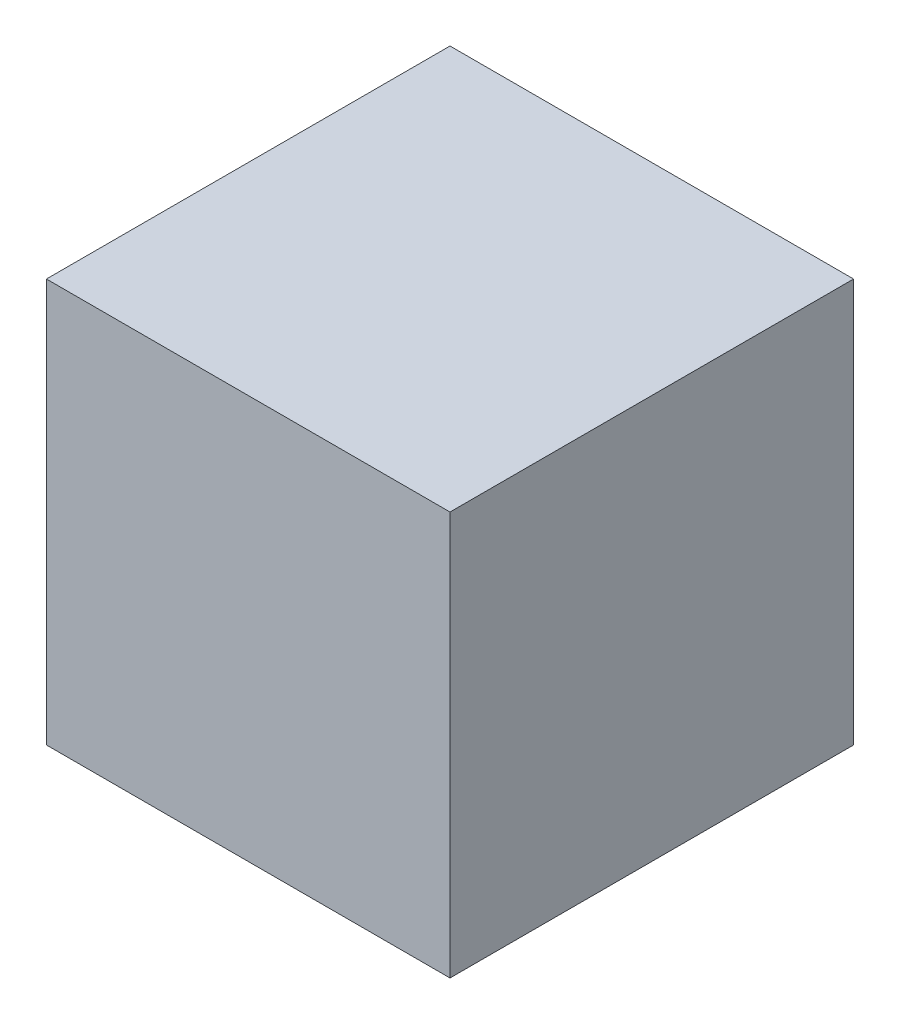
ISO-10303-21;
HEADER;
FILE_DESCRIPTION(('STEP AP214'),'2;1');
FILE_NAME('part.step','',(''),(''),'','','');
FILE_SCHEMA(('AUTOMOTIVE_DESIGN { 1 0 10303 214 1 1 1 1 }'));
ENDSEC;
DATA;
#1=APPLICATION_CONTEXT('core data for automotive mechanical design processes');
#2=APPLICATION_PROTOCOL_DEFINITION('international standard','automotive_design',2000,#1);
#3=PRODUCT_CONTEXT('',#1,'mechanical');
#4=PRODUCT('Part','Part','',(#3));
#5=PRODUCT_RELATED_PRODUCT_CATEGORY('part','',(#4));
#6=PRODUCT_DEFINITION_FORMATION('','',#4);
#7=PRODUCT_DEFINITION_CONTEXT('part definition',#1,'design');
#8=PRODUCT_DEFINITION('design','',#6,#7);
#9=PRODUCT_DEFINITION_SHAPE('','',#8);
#10=(LENGTH_UNIT() NAMED_UNIT(*) SI_UNIT(.MILLI.,.METRE.));
#11=(NAMED_UNIT(*) PLANE_ANGLE_UNIT() SI_UNIT($,.RADIAN.));
#12=(NAMED_UNIT(*) SI_UNIT($,.STERADIAN.) SOLID_ANGLE_UNIT());
#13=UNCERTAINTY_MEASURE_WITH_UNIT(LENGTH_MEASURE(1.E-05),#10,'distance_accuracy_value','');
#14=(GEOMETRIC_REPRESENTATION_CONTEXT(3) GLOBAL_UNCERTAINTY_ASSIGNED_CONTEXT((#13)) GLOBAL_UNIT_ASSIGNED_CONTEXT((#10,
#11,#12)) REPRESENTATION_CONTEXT('',''));
#15=CARTESIAN_POINT('',(0.,0.,0.));
#16=DIRECTION('',(0.,0.,1.));
#17=DIRECTION('',(1.,0.,0.));
#18=AXIS2_PLACEMENT_3D('',#15,#16,#17);
#19=CARTESIAN_POINT('',(30.,30.,60.));
#20=DIRECTION('',(-1.,0.,0.));
#21=DIRECTION('',(0.,-1.,0.));
#22=AXIS2_PLACEMENT_3D('',#19,#20,#21);
#23=PLANE('',#22);
#24=DIRECTION('',(0.,1.,0.));
#25=VECTOR('',#24,1.);
#26=CARTESIAN_POINT('',(30.,30.,0.));
#27=LINE('',#26,#25);
#28=CARTESIAN_POINT('',(30.,-30.,0.));
#29=VERTEX_POINT('',#28);
#30=CARTESIAN_POINT('',(30.,30.,0.));
#31=VERTEX_POINT('',#30);
#32=EDGE_CURVE('E100',#29,#31,#27,.T.);
#33=ORIENTED_EDGE('',*,*,#32,.T.);
#34=DIRECTION('',(0.,0.,-1.));
#35=VECTOR('',#34,1.);
#36=CARTESIAN_POINT('',(30.,30.,60.));
#37=LINE('',#36,#35);
#38=CARTESIAN_POINT('',(30.,30.,60.));
#39=VERTEX_POINT('',#38);
#40=EDGE_CURVE('E11',#39,#31,#37,.T.);
#41=ORIENTED_EDGE('',*,*,#40,.F.);
#42=DIRECTION('',(0.,1.,0.));
#43=VECTOR('',#42,1.);
#44=CARTESIAN_POINT('',(30.,30.,60.));
#45=LINE('',#44,#43);
#46=CARTESIAN_POINT('',(30.,-30.,60.));
#47=VERTEX_POINT('',#46);
#48=EDGE_CURVE('E88',#47,#39,#45,.T.);
#49=ORIENTED_EDGE('',*,*,#48,.F.);
#50=DIRECTION('',(0.,0.,-1.));
#51=VECTOR('',#50,1.);
#52=CARTESIAN_POINT('',(30.,-30.,60.));
#53=LINE('',#52,#51);
#54=EDGE_CURVE('E96',#47,#29,#53,.T.);
#55=ORIENTED_EDGE('',*,*,#54,.T.);
#56=EDGE_LOOP('',(#33,#41,#49,#55));
#57=FACE_BOUND('',#56,.T.);
#58=ADVANCED_FACE('F37',(#57),#23,.F.);
#59=CARTESIAN_POINT('',(-30.,30.,60.));
#60=DIRECTION('',(0.,-1.,0.));
#61=DIRECTION('',(0.,0.,-1.));
#62=AXIS2_PLACEMENT_3D('',#59,#60,#61);
#63=PLANE('',#62);
#64=DIRECTION('',(-1.,0.,0.));
#65=VECTOR('',#64,1.);
#66=CARTESIAN_POINT('',(-30.,30.,0.));
#67=LINE('',#66,#65);
#68=CARTESIAN_POINT('',(-30.,30.,0.));
#69=VERTEX_POINT('',#68);
#70=EDGE_CURVE('E92',#31,#69,#67,.T.);
#71=ORIENTED_EDGE('',*,*,#70,.T.);
#72=DIRECTION('',(0.,0.,-1.));
#73=VECTOR('',#72,1.);
#74=CARTESIAN_POINT('',(-30.,30.,60.));
#75=LINE('',#74,#73);
#76=CARTESIAN_POINT('',(-30.,30.,60.));
#77=VERTEX_POINT('',#76);
#78=EDGE_CURVE('E45',#77,#69,#75,.T.);
#79=ORIENTED_EDGE('',*,*,#78,.F.);
#80=DIRECTION('',(-1.,0.,0.));
#81=VECTOR('',#80,1.);
#82=CARTESIAN_POINT('',(-30.,30.,60.));
#83=LINE('',#82,#81);
#84=EDGE_CURVE('E83',#39,#77,#83,.T.);
#85=ORIENTED_EDGE('',*,*,#84,.F.);
#86=ORIENTED_EDGE('',*,*,#40,.T.);
#87=EDGE_LOOP('',(#71,#79,#85,#86));
#88=FACE_BOUND('',#87,.T.);
#89=ADVANCED_FACE('F91',(#88),#63,.F.);
#90=CARTESIAN_POINT('',(-30.,30.,60.));
#91=DIRECTION('',(1.,0.,0.));
#92=DIRECTION('',(0.,1.,0.));
#93=AXIS2_PLACEMENT_3D('',#90,#91,#92);
#94=PLANE('',#93);
#95=DIRECTION('',(0.,-1.,0.));
#96=VECTOR('',#95,1.);
#97=CARTESIAN_POINT('',(-30.,30.,0.));
#98=LINE('',#97,#96);
#99=CARTESIAN_POINT('',(-30.,-30.,0.));
#100=VERTEX_POINT('',#99);
#101=EDGE_CURVE('E70',#69,#100,#98,.T.);
#102=ORIENTED_EDGE('',*,*,#101,.T.);
#103=DIRECTION('',(0.,0.,-1.));
#104=VECTOR('',#103,1.);
#105=CARTESIAN_POINT('',(-30.,-30.,60.));
#106=LINE('',#105,#104);
#107=CARTESIAN_POINT('',(-30.,-30.,60.));
#108=VERTEX_POINT('',#107);
#109=EDGE_CURVE('E93',#108,#100,#106,.T.);
#110=ORIENTED_EDGE('',*,*,#109,.F.);
#111=DIRECTION('',(0.,-1.,0.));
#112=VECTOR('',#111,1.);
#113=CARTESIAN_POINT('',(-30.,30.,60.));
#114=LINE('',#113,#112);
#115=EDGE_CURVE('E86',#77,#108,#114,.T.);
#116=ORIENTED_EDGE('',*,*,#115,.F.);
#117=ORIENTED_EDGE('',*,*,#78,.T.);
#118=EDGE_LOOP('',(#102,#110,#116,#117));
#119=FACE_BOUND('',#118,.T.);
#120=ADVANCED_FACE('F94',(#119),#94,.F.);
#121=CARTESIAN_POINT('',(-30.,-30.,60.));
#122=DIRECTION('',(0.,1.,0.));
#123=DIRECTION('',(0.,0.,1.));
#124=AXIS2_PLACEMENT_3D('',#121,#122,#123);
#125=PLANE('',#124);
#126=DIRECTION('',(1.,0.,0.));
#127=VECTOR('',#126,1.);
#128=CARTESIAN_POINT('',(-30.,-30.,0.));
#129=LINE('',#128,#127);
#130=EDGE_CURVE('E76',#100,#29,#129,.T.);
#131=ORIENTED_EDGE('',*,*,#130,.T.);
#132=ORIENTED_EDGE('',*,*,#54,.F.);
#133=DIRECTION('',(1.,0.,0.));
#134=VECTOR('',#133,1.);
#135=CARTESIAN_POINT('',(-30.,-30.,60.));
#136=LINE('',#135,#134);
#137=EDGE_CURVE('E53',#108,#47,#136,.T.);
#138=ORIENTED_EDGE('',*,*,#137,.F.);
#139=ORIENTED_EDGE('',*,*,#109,.T.);
#140=EDGE_LOOP('',(#131,#132,#138,#139));
#141=FACE_BOUND('',#140,.T.);
#142=ADVANCED_FACE('F107',(#141),#125,.F.);
#143=CARTESIAN_POINT('',(0.,0.,60.));
#144=DIRECTION('',(0.,0.,1.));
#145=DIRECTION('',(1.,0.,0.));
#146=AXIS2_PLACEMENT_3D('',#143,#144,#145);
#147=PLANE('',#146);
#148=ORIENTED_EDGE('',*,*,#48,.T.);
#149=ORIENTED_EDGE('',*,*,#84,.T.);
#150=ORIENTED_EDGE('',*,*,#115,.T.);
#151=ORIENTED_EDGE('',*,*,#137,.T.);
#152=EDGE_LOOP('',(#148,#149,#150,#151));
#153=FACE_BOUND('',#152,.T.);
#154=ADVANCED_FACE('F84',(#153),#147,.T.);
#155=CARTESIAN_POINT('',(0.,0.,0.));
#156=DIRECTION('',(0.,0.,1.));
#157=DIRECTION('',(1.,0.,0.));
#158=AXIS2_PLACEMENT_3D('',#155,#156,#157);
#159=PLANE('',#158);
#160=ORIENTED_EDGE('',*,*,#32,.F.);
#161=ORIENTED_EDGE('',*,*,#130,.F.);
#162=ORIENTED_EDGE('',*,*,#101,.F.);
#163=ORIENTED_EDGE('',*,*,#70,.F.);
#164=EDGE_LOOP('',(#160,#161,#162,#163));
#165=FACE_BOUND('',#164,.T.);
#166=ADVANCED_FACE('F110',(#165),#159,.F.);
#167=CLOSED_SHELL('',(#58,#89,#120,#142,#154,#166));
#168=MANIFOLD_SOLID_BREP('B2',#167);
#169=ADVANCED_BREP_SHAPE_REPRESENTATION('',(#18,#168),#14);
#170=SHAPE_DEFINITION_REPRESENTATION(#9,#169);
ENDSEC;
END-ISO-10303-21;
